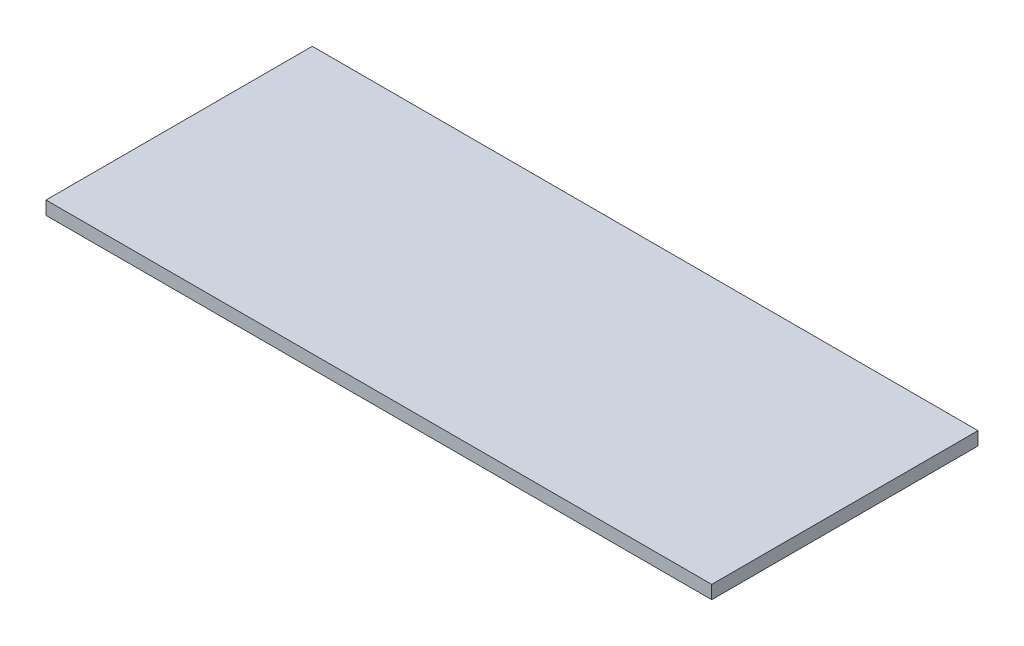
ISO-10303-21;
HEADER;
FILE_DESCRIPTION(('STEP AP214'),'2;1');
FILE_NAME('part.step','',(''),(''),'','','');
FILE_SCHEMA(('AUTOMOTIVE_DESIGN { 1 0 10303 214 1 1 1 1 }'));
ENDSEC;
DATA;
#1=APPLICATION_CONTEXT('core data for automotive mechanical design processes');
#2=APPLICATION_PROTOCOL_DEFINITION('international standard','automotive_design',2000,#1);
#3=PRODUCT_CONTEXT('',#1,'mechanical');
#4=PRODUCT('Part','Part','',(#3));
#5=PRODUCT_RELATED_PRODUCT_CATEGORY('part','',(#4));
#6=PRODUCT_DEFINITION_FORMATION('','',#4);
#7=PRODUCT_DEFINITION_CONTEXT('part definition',#1,'design');
#8=PRODUCT_DEFINITION('design','',#6,#7);
#9=PRODUCT_DEFINITION_SHAPE('','',#8);
#10=(LENGTH_UNIT() NAMED_UNIT(*) SI_UNIT(.MILLI.,.METRE.));
#11=(NAMED_UNIT(*) PLANE_ANGLE_UNIT() SI_UNIT($,.RADIAN.));
#12=(NAMED_UNIT(*) SI_UNIT($,.STERADIAN.) SOLID_ANGLE_UNIT());
#13=UNCERTAINTY_MEASURE_WITH_UNIT(LENGTH_MEASURE(1.E-05),#10,'distance_accuracy_value','');
#14=(GEOMETRIC_REPRESENTATION_CONTEXT(3) GLOBAL_UNCERTAINTY_ASSIGNED_CONTEXT((#13)) GLOBAL_UNIT_ASSIGNED_CONTEXT((#10,
#11,#12)) REPRESENTATION_CONTEXT('',''));
#15=CARTESIAN_POINT('',(0.,0.,0.));
#16=DIRECTION('',(0.,0.,1.));
#17=DIRECTION('',(1.,0.,0.));
#18=AXIS2_PLACEMENT_3D('',#15,#16,#17);
#19=CARTESIAN_POINT('',(-250.,10.,100.));
#20=DIRECTION('',(1.,0.,0.));
#21=DIRECTION('',(0.,0.,-1.));
#22=AXIS2_PLACEMENT_3D('',#19,#20,#21);
#23=PLANE('',#22);
#24=DIRECTION('',(0.,0.,1.));
#25=VECTOR('',#24,1.);
#26=CARTESIAN_POINT('',(-250.,0.,100.));
#27=LINE('',#26,#25);
#28=CARTESIAN_POINT('',(-250.,0.,-100.));
#29=VERTEX_POINT('',#28);
#30=CARTESIAN_POINT('',(-250.,0.,100.));
#31=VERTEX_POINT('',#30);
#32=EDGE_CURVE('E107',#29,#31,#27,.T.);
#33=ORIENTED_EDGE('',*,*,#32,.T.);
#34=DIRECTION('',(0.,-1.,0.));
#35=VECTOR('',#34,1.);
#36=CARTESIAN_POINT('',(-250.,10.,100.));
#37=LINE('',#36,#35);
#38=CARTESIAN_POINT('',(-250.,10.,100.));
#39=VERTEX_POINT('',#38);
#40=EDGE_CURVE('E11',#39,#31,#37,.T.);
#41=ORIENTED_EDGE('',*,*,#40,.F.);
#42=DIRECTION('',(0.,0.,1.));
#43=VECTOR('',#42,1.);
#44=CARTESIAN_POINT('',(-250.,10.,100.));
#45=LINE('',#44,#43);
#46=CARTESIAN_POINT('',(-250.,10.,-100.));
#47=VERTEX_POINT('',#46);
#48=EDGE_CURVE('E91',#47,#39,#45,.T.);
#49=ORIENTED_EDGE('',*,*,#48,.F.);
#50=DIRECTION('',(0.,-1.,0.));
#51=VECTOR('',#50,1.);
#52=CARTESIAN_POINT('',(-250.,10.,-100.));
#53=LINE('',#52,#51);
#54=EDGE_CURVE('E103',#47,#29,#53,.T.);
#55=ORIENTED_EDGE('',*,*,#54,.T.);
#56=EDGE_LOOP('',(#33,#41,#49,#55));
#57=FACE_BOUND('',#56,.T.);
#58=ADVANCED_FACE('F39',(#57),#23,.F.);
#59=CARTESIAN_POINT('',(250.,10.,99.9999999999999));
#60=DIRECTION('',(0.,0.,-1.));
#61=DIRECTION('',(-1.,0.,0.));
#62=AXIS2_PLACEMENT_3D('',#59,#60,#61);
#63=PLANE('',#62);
#64=DIRECTION('',(1.,0.,0.));
#65=VECTOR('',#64,1.);
#66=CARTESIAN_POINT('',(250.,0.,99.9999999999999));
#67=LINE('',#66,#65);
#68=CARTESIAN_POINT('',(250.,0.,99.9999999999999));
#69=VERTEX_POINT('',#68);
#70=EDGE_CURVE('E96',#31,#69,#67,.T.);
#71=ORIENTED_EDGE('',*,*,#70,.T.);
#72=DIRECTION('',(0.,-1.,0.));
#73=VECTOR('',#72,1.);
#74=CARTESIAN_POINT('',(250.,10.,99.9999999999999));
#75=LINE('',#74,#73);
#76=CARTESIAN_POINT('',(250.,10.,99.9999999999999));
#77=VERTEX_POINT('',#76);
#78=EDGE_CURVE('E48',#77,#69,#75,.T.);
#79=ORIENTED_EDGE('',*,*,#78,.F.);
#80=DIRECTION('',(1.,0.,0.));
#81=VECTOR('',#80,1.);
#82=CARTESIAN_POINT('',(250.,10.,99.9999999999999));
#83=LINE('',#82,#81);
#84=EDGE_CURVE('E86',#39,#77,#83,.T.);
#85=ORIENTED_EDGE('',*,*,#84,.F.);
#86=ORIENTED_EDGE('',*,*,#40,.T.);
#87=EDGE_LOOP('',(#71,#79,#85,#86));
#88=FACE_BOUND('',#87,.T.);
#89=ADVANCED_FACE('F95',(#88),#63,.F.);
#90=CARTESIAN_POINT('',(250.,10.,99.9999999999999));
#91=DIRECTION('',(-1.,0.,0.));
#92=DIRECTION('',(0.,0.,1.));
#93=AXIS2_PLACEMENT_3D('',#90,#91,#92);
#94=PLANE('',#93);
#95=DIRECTION('',(0.,0.,-1.));
#96=VECTOR('',#95,1.);
#97=CARTESIAN_POINT('',(250.,0.,99.9999999999999));
#98=LINE('',#97,#96);
#99=CARTESIAN_POINT('',(250.,0.,-100.));
#100=VERTEX_POINT('',#99);
#101=EDGE_CURVE('E73',#69,#100,#98,.T.);
#102=ORIENTED_EDGE('',*,*,#101,.T.);
#103=DIRECTION('',(0.,-1.,0.));
#104=VECTOR('',#103,1.);
#105=CARTESIAN_POINT('',(250.,10.,-100.));
#106=LINE('',#105,#104);
#107=CARTESIAN_POINT('',(250.,10.,-100.));
#108=VERTEX_POINT('',#107);
#109=EDGE_CURVE('E98',#108,#100,#106,.T.);
#110=ORIENTED_EDGE('',*,*,#109,.F.);
#111=DIRECTION('',(0.,0.,-1.));
#112=VECTOR('',#111,1.);
#113=CARTESIAN_POINT('',(250.,10.,99.9999999999999));
#114=LINE('',#113,#112);
#115=EDGE_CURVE('E89',#77,#108,#114,.T.);
#116=ORIENTED_EDGE('',*,*,#115,.F.);
#117=ORIENTED_EDGE('',*,*,#78,.T.);
#118=EDGE_LOOP('',(#102,#110,#116,#117));
#119=FACE_BOUND('',#118,.T.);
#120=ADVANCED_FACE('F99',(#119),#94,.F.);
#121=CARTESIAN_POINT('',(250.,10.,-100.));
#122=DIRECTION('',(0.,0.,1.));
#123=DIRECTION('',(1.,0.,0.));
#124=AXIS2_PLACEMENT_3D('',#121,#122,#123);
#125=PLANE('',#124);
#126=DIRECTION('',(-1.,0.,0.));
#127=VECTOR('',#126,1.);
#128=CARTESIAN_POINT('',(250.,0.,-100.));
#129=LINE('',#128,#127);
#130=EDGE_CURVE('E79',#100,#29,#129,.T.);
#131=ORIENTED_EDGE('',*,*,#130,.T.);
#132=ORIENTED_EDGE('',*,*,#54,.F.);
#133=DIRECTION('',(-1.,0.,0.));
#134=VECTOR('',#133,1.);
#135=CARTESIAN_POINT('',(250.,10.,-100.));
#136=LINE('',#135,#134);
#137=EDGE_CURVE('E56',#108,#47,#136,.T.);
#138=ORIENTED_EDGE('',*,*,#137,.F.);
#139=ORIENTED_EDGE('',*,*,#109,.T.);
#140=EDGE_LOOP('',(#131,#132,#138,#139));
#141=FACE_BOUND('',#140,.T.);
#142=ADVANCED_FACE('F120',(#141),#125,.F.);
#143=CARTESIAN_POINT('',(0.,10.,0.));
#144=DIRECTION('',(0.,1.,0.));
#145=DIRECTION('',(0.,0.,1.));
#146=AXIS2_PLACEMENT_3D('',#143,#144,#145);
#147=PLANE('',#146);
#148=ORIENTED_EDGE('',*,*,#48,.T.);
#149=ORIENTED_EDGE('',*,*,#84,.T.);
#150=ORIENTED_EDGE('',*,*,#115,.T.);
#151=ORIENTED_EDGE('',*,*,#137,.T.);
#152=EDGE_LOOP('',(#148,#149,#150,#151));
#153=FACE_BOUND('',#152,.T.);
#154=ADVANCED_FACE('F87',(#153),#147,.T.);
#155=CARTESIAN_POINT('',(0.,0.,0.));
#156=DIRECTION('',(0.,1.,0.));
#157=DIRECTION('',(0.,0.,1.));
#158=AXIS2_PLACEMENT_3D('',#155,#156,#157);
#159=PLANE('',#158);
#160=ORIENTED_EDGE('',*,*,#32,.F.);
#161=ORIENTED_EDGE('',*,*,#130,.F.);
#162=ORIENTED_EDGE('',*,*,#101,.F.);
#163=ORIENTED_EDGE('',*,*,#70,.F.);
#164=EDGE_LOOP('',(#160,#161,#162,#163));
#165=FACE_BOUND('',#164,.T.);
#166=ADVANCED_FACE('F123',(#165),#159,.F.);
#167=CLOSED_SHELL('',(#58,#89,#120,#142,#154,#166));
#168=MANIFOLD_SOLID_BREP('B2',#167);
#169=ADVANCED_BREP_SHAPE_REPRESENTATION('',(#18,#168),#14);
#170=SHAPE_DEFINITION_REPRESENTATION(#9,#169);
ENDSEC;
END-ISO-10303-21;
